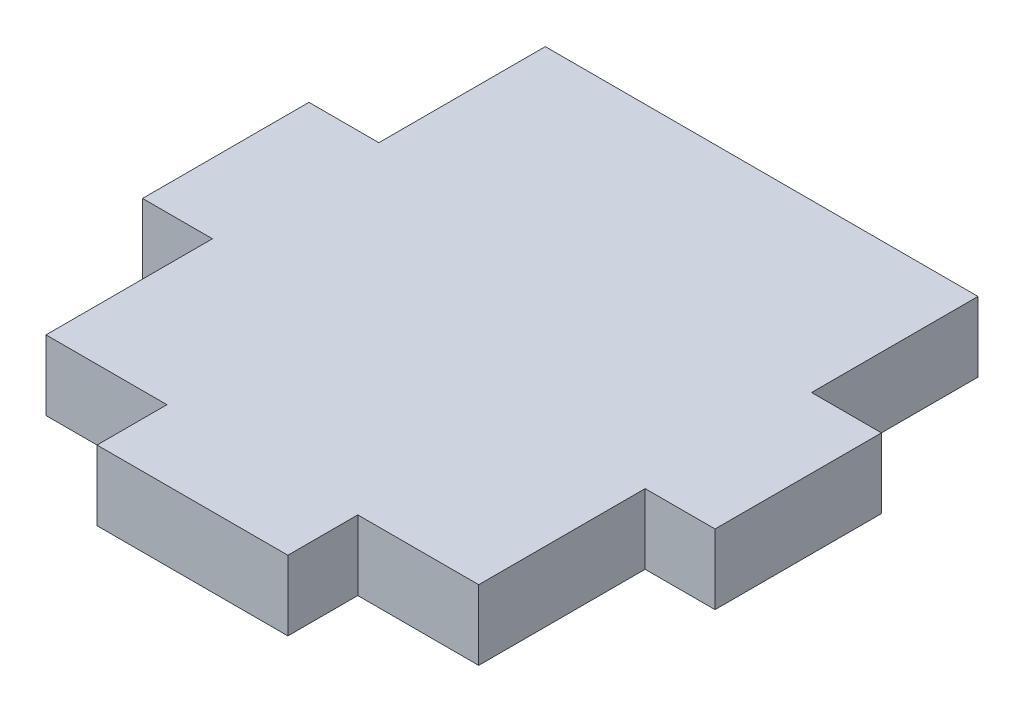
ISO-10303-21;
HEADER;
FILE_DESCRIPTION(('STEP AP214'),'2;1');
FILE_NAME('part.step','',(''),(''),'','','');
FILE_SCHEMA(('AUTOMOTIVE_DESIGN { 1 0 10303 214 1 1 1 1 }'));
ENDSEC;
DATA;
#1=APPLICATION_CONTEXT('core data for automotive mechanical design processes');
#2=APPLICATION_PROTOCOL_DEFINITION('international standard','automotive_design',2000,#1);
#3=PRODUCT_CONTEXT('',#1,'mechanical');
#4=PRODUCT('Part','Part','',(#3));
#5=PRODUCT_RELATED_PRODUCT_CATEGORY('part','',(#4));
#6=PRODUCT_DEFINITION_FORMATION('','',#4);
#7=PRODUCT_DEFINITION_CONTEXT('part definition',#1,'design');
#8=PRODUCT_DEFINITION('design','',#6,#7);
#9=PRODUCT_DEFINITION_SHAPE('','',#8);
#10=(LENGTH_UNIT() NAMED_UNIT(*) SI_UNIT(.MILLI.,.METRE.));
#11=(NAMED_UNIT(*) PLANE_ANGLE_UNIT() SI_UNIT($,.RADIAN.));
#12=(NAMED_UNIT(*) SI_UNIT($,.STERADIAN.) SOLID_ANGLE_UNIT());
#13=UNCERTAINTY_MEASURE_WITH_UNIT(LENGTH_MEASURE(1.E-05),#10,'distance_accuracy_value','');
#14=(GEOMETRIC_REPRESENTATION_CONTEXT(3) GLOBAL_UNCERTAINTY_ASSIGNED_CONTEXT((#13)) GLOBAL_UNIT_ASSIGNED_CONTEXT((#10,
#11,#12)) REPRESENTATION_CONTEXT('',''));
#15=CARTESIAN_POINT('',(0.,0.,0.));
#16=DIRECTION('',(0.,0.,1.));
#17=DIRECTION('',(1.,0.,0.));
#18=AXIS2_PLACEMENT_3D('',#15,#16,#17);
#19=CARTESIAN_POINT('',(16.51,2.667,19.05));
#20=DIRECTION('',(-1.,0.,0.));
#21=DIRECTION('',(0.,0.,1.));
#22=AXIS2_PLACEMENT_3D('',#19,#20,#21);
#23=PLANE('',#22);
#24=DIRECTION('',(0.,1.,0.));
#25=VECTOR('',#24,1.);
#26=CARTESIAN_POINT('',(16.51,-2.667,-6.35));
#27=LINE('',#26,#25);
#28=CARTESIAN_POINT('',(16.51,-2.667,-6.35));
#29=VERTEX_POINT('',#28);
#30=CARTESIAN_POINT('',(16.51,2.667,-6.35));
#31=VERTEX_POINT('',#30);
#32=EDGE_CURVE('E179',#29,#31,#27,.T.);
#33=ORIENTED_EDGE('',*,*,#32,.F.);
#34=DIRECTION('',(0.,0.,-1.));
#35=VECTOR('',#34,1.);
#36=CARTESIAN_POINT('',(16.51,-2.667,19.05));
#37=LINE('',#36,#35);
#38=CARTESIAN_POINT('',(16.51,-2.667,-19.05));
#39=VERTEX_POINT('',#38);
#40=EDGE_CURVE('E220',#29,#39,#37,.T.);
#41=ORIENTED_EDGE('',*,*,#40,.T.);
#42=DIRECTION('',(0.,-1.,0.));
#43=VECTOR('',#42,1.);
#44=CARTESIAN_POINT('',(16.51,2.667,-19.05));
#45=LINE('',#44,#43);
#46=CARTESIAN_POINT('',(16.51,2.667,-19.05));
#47=VERTEX_POINT('',#46);
#48=EDGE_CURVE('E11',#47,#39,#45,.T.);
#49=ORIENTED_EDGE('',*,*,#48,.F.);
#50=DIRECTION('',(0.,0.,-1.));
#51=VECTOR('',#50,1.);
#52=CARTESIAN_POINT('',(16.51,2.667,19.05));
#53=LINE('',#52,#51);
#54=EDGE_CURVE('E274',#31,#47,#53,.T.);
#55=ORIENTED_EDGE('',*,*,#54,.F.);
#56=EDGE_LOOP('',(#33,#41,#49,#55));
#57=FACE_BOUND('',#56,.T.);
#58=ADVANCED_FACE('F34',(#57),#23,.F.);
#59=CARTESIAN_POINT('',(-16.51,2.667,19.05));
#60=DIRECTION('',(1.,0.,0.));
#61=DIRECTION('',(0.,0.,-1.));
#62=AXIS2_PLACEMENT_3D('',#59,#60,#61);
#63=PLANE('',#62);
#64=DIRECTION('',(0.,1.,0.));
#65=VECTOR('',#64,1.);
#66=CARTESIAN_POINT('',(-16.51,-2.667,6.35));
#67=LINE('',#66,#65);
#68=CARTESIAN_POINT('',(-16.51,-2.667,6.35));
#69=VERTEX_POINT('',#68);
#70=CARTESIAN_POINT('',(-16.51,2.667,6.35));
#71=VERTEX_POINT('',#70);
#72=EDGE_CURVE('E202',#69,#71,#67,.T.);
#73=ORIENTED_EDGE('',*,*,#72,.F.);
#74=DIRECTION('',(0.,0.,1.));
#75=VECTOR('',#74,1.);
#76=CARTESIAN_POINT('',(-16.51,-2.667,19.05));
#77=LINE('',#76,#75);
#78=CARTESIAN_POINT('',(-16.51,-2.667,19.05));
#79=VERTEX_POINT('',#78);
#80=EDGE_CURVE('E229',#69,#79,#77,.T.);
#81=ORIENTED_EDGE('',*,*,#80,.T.);
#82=DIRECTION('',(0.,-1.,0.));
#83=VECTOR('',#82,1.);
#84=CARTESIAN_POINT('',(-16.51,2.667,19.05));
#85=LINE('',#84,#83);
#86=CARTESIAN_POINT('',(-16.51,2.667,19.05));
#87=VERTEX_POINT('',#86);
#88=EDGE_CURVE('E329',#87,#79,#85,.T.);
#89=ORIENTED_EDGE('',*,*,#88,.F.);
#90=DIRECTION('',(0.,0.,1.));
#91=VECTOR('',#90,1.);
#92=CARTESIAN_POINT('',(-16.51,2.667,19.05));
#93=LINE('',#92,#91);
#94=EDGE_CURVE('E280',#71,#87,#93,.T.);
#95=ORIENTED_EDGE('',*,*,#94,.F.);
#96=EDGE_LOOP('',(#73,#81,#89,#95));
#97=FACE_BOUND('',#96,.T.);
#98=ADVANCED_FACE('F370',(#97),#63,.F.);
#99=CARTESIAN_POINT('',(-16.51,2.667,19.05));
#100=DIRECTION('',(0.,0.,-1.));
#101=DIRECTION('',(-1.,0.,0.));
#102=AXIS2_PLACEMENT_3D('',#99,#100,#101);
#103=PLANE('',#102);
#104=DIRECTION('',(0.,1.,0.));
#105=VECTOR('',#104,1.);
#106=CARTESIAN_POINT('',(7.28133333333333,-2.667,19.05));
#107=LINE('',#106,#105);
#108=CARTESIAN_POINT('',(7.28133333333333,-2.667,19.05));
#109=VERTEX_POINT('',#108);
#110=CARTESIAN_POINT('',(7.28133333333333,2.667,19.05));
#111=VERTEX_POINT('',#110);
#112=EDGE_CURVE('E255',#109,#111,#107,.T.);
#113=ORIENTED_EDGE('',*,*,#112,.F.);
#114=DIRECTION('',(1.,0.,0.));
#115=VECTOR('',#114,1.);
#116=CARTESIAN_POINT('',(-16.51,-2.667,19.05));
#117=LINE('',#116,#115);
#118=CARTESIAN_POINT('',(16.51,-2.667,19.05));
#119=VERTEX_POINT('',#118);
#120=EDGE_CURVE('E241',#109,#119,#117,.T.);
#121=ORIENTED_EDGE('',*,*,#120,.T.);
#122=DIRECTION('',(0.,-1.,0.));
#123=VECTOR('',#122,1.);
#124=CARTESIAN_POINT('',(16.51,2.667,19.05));
#125=LINE('',#124,#123);
#126=CARTESIAN_POINT('',(16.51,2.667,19.05));
#127=VERTEX_POINT('',#126);
#128=EDGE_CURVE('E296',#127,#119,#125,.T.);
#129=ORIENTED_EDGE('',*,*,#128,.F.);
#130=DIRECTION('',(1.,0.,0.));
#131=VECTOR('',#130,1.);
#132=CARTESIAN_POINT('',(-16.51,2.667,19.05));
#133=LINE('',#132,#131);
#134=EDGE_CURVE('E297',#111,#127,#133,.T.);
#135=ORIENTED_EDGE('',*,*,#134,.F.);
#136=EDGE_LOOP('',(#113,#121,#129,#135));
#137=FACE_BOUND('',#136,.T.);
#138=ADVANCED_FACE('F325',(#137),#103,.F.);
#139=CARTESIAN_POINT('',(16.51,-2.667,6.35));
#140=VERTEX_POINT('',#139);
#141=EDGE_CURVE('E216',#119,#140,#37,.T.);
#142=ORIENTED_EDGE('',*,*,#141,.T.);
#143=DIRECTION('',(0.,1.,0.));
#144=VECTOR('',#143,1.);
#145=CARTESIAN_POINT('',(16.51,-2.667,6.35));
#146=LINE('',#145,#144);
#147=CARTESIAN_POINT('',(16.51,2.667,6.35));
#148=VERTEX_POINT('',#147);
#149=EDGE_CURVE('E169',#140,#148,#146,.T.);
#150=ORIENTED_EDGE('',*,*,#149,.T.);
#151=EDGE_CURVE('E276',#127,#148,#53,.T.);
#152=ORIENTED_EDGE('',*,*,#151,.F.);
#153=ORIENTED_EDGE('',*,*,#128,.T.);
#154=EDGE_LOOP('',(#142,#150,#152,#153));
#155=FACE_BOUND('',#154,.T.);
#156=ADVANCED_FACE('F36',(#155),#23,.F.);
#157=CARTESIAN_POINT('',(-16.51,2.667,-19.05));
#158=DIRECTION('',(0.,0.,1.));
#159=DIRECTION('',(1.,0.,0.));
#160=AXIS2_PLACEMENT_3D('',#157,#158,#159);
#161=PLANE('',#160);
#162=DIRECTION('',(-1.,0.,0.));
#163=VECTOR('',#162,1.);
#164=CARTESIAN_POINT('',(-16.51,-2.667,-19.05));
#165=LINE('',#164,#163);
#166=CARTESIAN_POINT('',(-16.51,-2.667,-19.05));
#167=VERTEX_POINT('',#166);
#168=EDGE_CURVE('E219',#39,#167,#165,.T.);
#169=ORIENTED_EDGE('',*,*,#168,.T.);
#170=DIRECTION('',(0.,-1.,0.));
#171=VECTOR('',#170,1.);
#172=CARTESIAN_POINT('',(-16.51,2.667,-19.05));
#173=LINE('',#172,#171);
#174=CARTESIAN_POINT('',(-16.51,2.667,-19.05));
#175=VERTEX_POINT('',#174);
#176=EDGE_CURVE('E43',#175,#167,#173,.T.);
#177=ORIENTED_EDGE('',*,*,#176,.F.);
#178=DIRECTION('',(-1.,0.,0.));
#179=VECTOR('',#178,1.);
#180=CARTESIAN_POINT('',(-16.51,2.667,-19.05));
#181=LINE('',#180,#179);
#182=EDGE_CURVE('E271',#47,#175,#181,.T.);
#183=ORIENTED_EDGE('',*,*,#182,.F.);
#184=ORIENTED_EDGE('',*,*,#48,.T.);
#185=EDGE_LOOP('',(#169,#177,#183,#184));
#186=FACE_BOUND('',#185,.T.);
#187=ADVANCED_FACE('F353',(#186),#161,.F.);
#188=CARTESIAN_POINT('',(-16.51,-2.667,-6.35));
#189=VERTEX_POINT('',#188);
#190=EDGE_CURVE('E238',#167,#189,#77,.T.);
#191=ORIENTED_EDGE('',*,*,#190,.T.);
#192=DIRECTION('',(0.,1.,0.));
#193=VECTOR('',#192,1.);
#194=CARTESIAN_POINT('',(-16.51,-2.667,-6.35));
#195=LINE('',#194,#193);
#196=CARTESIAN_POINT('',(-16.51,2.667,-6.34999999999999));
#197=VERTEX_POINT('',#196);
#198=EDGE_CURVE('E209',#189,#197,#195,.T.);
#199=ORIENTED_EDGE('',*,*,#198,.T.);
#200=EDGE_CURVE('E299',#175,#197,#93,.T.);
#201=ORIENTED_EDGE('',*,*,#200,.F.);
#202=ORIENTED_EDGE('',*,*,#176,.T.);
#203=EDGE_LOOP('',(#191,#199,#201,#202));
#204=FACE_BOUND('',#203,.T.);
#205=ADVANCED_FACE('F336',(#204),#63,.F.);
#206=CARTESIAN_POINT('',(-7.28133333333333,-2.667,19.05));
#207=VERTEX_POINT('',#206);
#208=EDGE_CURVE('E281',#79,#207,#117,.T.);
#209=ORIENTED_EDGE('',*,*,#208,.T.);
#210=DIRECTION('',(0.,1.,0.));
#211=VECTOR('',#210,1.);
#212=CARTESIAN_POINT('',(-7.28133333333333,-2.667,19.05));
#213=LINE('',#212,#211);
#214=CARTESIAN_POINT('',(-7.28133333333333,2.667,19.05));
#215=VERTEX_POINT('',#214);
#216=EDGE_CURVE('E258',#207,#215,#213,.T.);
#217=ORIENTED_EDGE('',*,*,#216,.T.);
#218=EDGE_CURVE('E293',#87,#215,#133,.T.);
#219=ORIENTED_EDGE('',*,*,#218,.F.);
#220=ORIENTED_EDGE('',*,*,#88,.T.);
#221=EDGE_LOOP('',(#209,#217,#219,#220));
#222=FACE_BOUND('',#221,.T.);
#223=ADVANCED_FACE('F382',(#222),#103,.F.);
#224=CARTESIAN_POINT('',(16.51,2.667,-19.05));
#225=DIRECTION('',(0.,-1.,0.));
#226=DIRECTION('',(0.,0.,-1.));
#227=AXIS2_PLACEMENT_3D('',#224,#225,#226);
#228=PLANE('',#227);
#229=ORIENTED_EDGE('',*,*,#151,.T.);
#230=DIRECTION('',(1.,0.,0.));
#231=VECTOR('',#230,1.);
#232=CARTESIAN_POINT('',(16.51,2.667,6.35));
#233=LINE('',#232,#231);
#234=CARTESIAN_POINT('',(21.844,2.667,6.35));
#235=VERTEX_POINT('',#234);
#236=EDGE_CURVE('E51',#148,#235,#233,.T.);
#237=ORIENTED_EDGE('',*,*,#236,.T.);
#238=DIRECTION('',(0.,0.,-1.));
#239=VECTOR('',#238,1.);
#240=CARTESIAN_POINT('',(21.844,2.667,6.35));
#241=LINE('',#240,#239);
#242=CARTESIAN_POINT('',(21.844,2.667,-6.35));
#243=VERTEX_POINT('',#242);
#244=EDGE_CURVE('E154',#235,#243,#241,.T.);
#245=ORIENTED_EDGE('',*,*,#244,.T.);
#246=DIRECTION('',(-1.,0.,0.));
#247=VECTOR('',#246,1.);
#248=CARTESIAN_POINT('',(16.51,2.667,-6.35));
#249=LINE('',#248,#247);
#250=EDGE_CURVE('E170',#243,#31,#249,.T.);
#251=ORIENTED_EDGE('',*,*,#250,.T.);
#252=ORIENTED_EDGE('',*,*,#54,.T.);
#253=ORIENTED_EDGE('',*,*,#182,.T.);
#254=ORIENTED_EDGE('',*,*,#200,.T.);
#255=DIRECTION('',(-1.,0.,0.));
#256=VECTOR('',#255,1.);
#257=CARTESIAN_POINT('',(-16.51,2.667,-6.35));
#258=LINE('',#257,#256);
#259=CARTESIAN_POINT('',(-21.844,2.667,-6.35));
#260=VERTEX_POINT('',#259);
#261=EDGE_CURVE('E59',#197,#260,#258,.T.);
#262=ORIENTED_EDGE('',*,*,#261,.T.);
#263=DIRECTION('',(0.,0.,1.));
#264=VECTOR('',#263,1.);
#265=CARTESIAN_POINT('',(-21.844,2.667,6.35));
#266=LINE('',#265,#264);
#267=CARTESIAN_POINT('',(-21.844,2.667,6.35));
#268=VERTEX_POINT('',#267);
#269=EDGE_CURVE('E193',#260,#268,#266,.T.);
#270=ORIENTED_EDGE('',*,*,#269,.T.);
#271=DIRECTION('',(1.,0.,0.));
#272=VECTOR('',#271,1.);
#273=CARTESIAN_POINT('',(-16.51,2.667,6.35));
#274=LINE('',#273,#272);
#275=EDGE_CURVE('E196',#268,#71,#274,.T.);
#276=ORIENTED_EDGE('',*,*,#275,.T.);
#277=ORIENTED_EDGE('',*,*,#94,.T.);
#278=ORIENTED_EDGE('',*,*,#218,.T.);
#279=DIRECTION('',(0.,0.,1.));
#280=VECTOR('',#279,1.);
#281=CARTESIAN_POINT('',(-7.28133333333333,2.667,19.05));
#282=LINE('',#281,#280);
#283=CARTESIAN_POINT('',(-7.28133333333334,2.667,24.384));
#284=VERTEX_POINT('',#283);
#285=EDGE_CURVE('E205',#215,#284,#282,.T.);
#286=ORIENTED_EDGE('',*,*,#285,.T.);
#287=DIRECTION('',(1.,0.,0.));
#288=VECTOR('',#287,1.);
#289=CARTESIAN_POINT('',(-7.28133333333334,2.667,24.384));
#290=LINE('',#289,#288);
#291=CARTESIAN_POINT('',(7.28133333333334,2.667,24.384));
#292=VERTEX_POINT('',#291);
#293=EDGE_CURVE('E248',#284,#292,#290,.T.);
#294=ORIENTED_EDGE('',*,*,#293,.T.);
#295=DIRECTION('',(0.,0.,-1.));
#296=VECTOR('',#295,1.);
#297=CARTESIAN_POINT('',(7.28133333333333,2.667,19.05));
#298=LINE('',#297,#296);
#299=EDGE_CURVE('E244',#292,#111,#298,.T.);
#300=ORIENTED_EDGE('',*,*,#299,.T.);
#301=ORIENTED_EDGE('',*,*,#134,.T.);
#302=EDGE_LOOP('',(#229,#237,#245,#251,#252,#253,#254,#262,#270,#276,#277,#278,#286,#294,#300,#301));
#303=FACE_BOUND('',#302,.T.);
#304=ADVANCED_FACE('F315',(#303),#228,.F.);
#305=CARTESIAN_POINT('',(16.51,-2.667,-19.05));
#306=DIRECTION('',(0.,-1.,0.));
#307=DIRECTION('',(0.,0.,-1.));
#308=AXIS2_PLACEMENT_3D('',#305,#306,#307);
#309=PLANE('',#308);
#310=ORIENTED_EDGE('',*,*,#141,.F.);
#311=ORIENTED_EDGE('',*,*,#120,.F.);
#312=DIRECTION('',(0.,0.,-1.));
#313=VECTOR('',#312,1.);
#314=CARTESIAN_POINT('',(7.28133333333333,-2.667,19.05));
#315=LINE('',#314,#313);
#316=CARTESIAN_POINT('',(7.28133333333334,-2.667,24.384));
#317=VERTEX_POINT('',#316);
#318=EDGE_CURVE('E251',#317,#109,#315,.T.);
#319=ORIENTED_EDGE('',*,*,#318,.F.);
#320=DIRECTION('',(1.,0.,0.));
#321=VECTOR('',#320,1.);
#322=CARTESIAN_POINT('',(-7.28133333333334,-2.667,24.384));
#323=LINE('',#322,#321);
#324=CARTESIAN_POINT('',(-7.28133333333334,-2.667,24.384));
#325=VERTEX_POINT('',#324);
#326=EDGE_CURVE('E254',#325,#317,#323,.T.);
#327=ORIENTED_EDGE('',*,*,#326,.F.);
#328=DIRECTION('',(0.,0.,1.));
#329=VECTOR('',#328,1.);
#330=CARTESIAN_POINT('',(-7.28133333333333,-2.667,19.05));
#331=LINE('',#330,#329);
#332=EDGE_CURVE('E247',#207,#325,#331,.T.);
#333=ORIENTED_EDGE('',*,*,#332,.F.);
#334=ORIENTED_EDGE('',*,*,#208,.F.);
#335=ORIENTED_EDGE('',*,*,#80,.F.);
#336=DIRECTION('',(1.,0.,0.));
#337=VECTOR('',#336,1.);
#338=CARTESIAN_POINT('',(-16.51,-2.667,6.35));
#339=LINE('',#338,#337);
#340=CARTESIAN_POINT('',(-21.844,-2.667,6.35));
#341=VERTEX_POINT('',#340);
#342=EDGE_CURVE('E191',#341,#69,#339,.T.);
#343=ORIENTED_EDGE('',*,*,#342,.F.);
#344=DIRECTION('',(0.,0.,1.));
#345=VECTOR('',#344,1.);
#346=CARTESIAN_POINT('',(-21.844,-2.667,6.35));
#347=LINE('',#346,#345);
#348=CARTESIAN_POINT('',(-21.844,-2.667,-6.35));
#349=VERTEX_POINT('',#348);
#350=EDGE_CURVE('E188',#349,#341,#347,.T.);
#351=ORIENTED_EDGE('',*,*,#350,.F.);
#352=DIRECTION('',(-1.,0.,0.));
#353=VECTOR('',#352,1.);
#354=CARTESIAN_POINT('',(-16.51,-2.667,-6.35));
#355=LINE('',#354,#353);
#356=EDGE_CURVE('E192',#189,#349,#355,.T.);
#357=ORIENTED_EDGE('',*,*,#356,.F.);
#358=ORIENTED_EDGE('',*,*,#190,.F.);
#359=ORIENTED_EDGE('',*,*,#168,.F.);
#360=ORIENTED_EDGE('',*,*,#40,.F.);
#361=DIRECTION('',(-1.,0.,0.));
#362=VECTOR('',#361,1.);
#363=CARTESIAN_POINT('',(16.51,-2.667,-6.35));
#364=LINE('',#363,#362);
#365=CARTESIAN_POINT('',(21.844,-2.667,-6.35));
#366=VERTEX_POINT('',#365);
#367=EDGE_CURVE('E157',#366,#29,#364,.T.);
#368=ORIENTED_EDGE('',*,*,#367,.F.);
#369=DIRECTION('',(0.,0.,-1.));
#370=VECTOR('',#369,1.);
#371=CARTESIAN_POINT('',(21.844,-2.667,6.35));
#372=LINE('',#371,#370);
#373=CARTESIAN_POINT('',(21.844,-2.667,6.35));
#374=VERTEX_POINT('',#373);
#375=EDGE_CURVE('E152',#374,#366,#372,.T.);
#376=ORIENTED_EDGE('',*,*,#375,.F.);
#377=DIRECTION('',(1.,0.,0.));
#378=VECTOR('',#377,1.);
#379=CARTESIAN_POINT('',(16.51,-2.667,6.35));
#380=LINE('',#379,#378);
#381=EDGE_CURVE('E164',#140,#374,#380,.T.);
#382=ORIENTED_EDGE('',*,*,#381,.F.);
#383=EDGE_LOOP('',(#310,#311,#319,#327,#333,#334,#335,#343,#351,#357,#358,#359,#360,#368,#376,#382));
#384=FACE_BOUND('',#383,.T.);
#385=ADVANCED_FACE('F163',(#384),#309,.T.);
#386=CARTESIAN_POINT('',(-7.28133333333333,-2.667,19.05));
#387=DIRECTION('',(-1.,0.,0.));
#388=DIRECTION('',(0.,0.,1.));
#389=AXIS2_PLACEMENT_3D('',#386,#387,#388);
#390=PLANE('',#389);
#391=ORIENTED_EDGE('',*,*,#285,.F.);
#392=ORIENTED_EDGE('',*,*,#216,.F.);
#393=ORIENTED_EDGE('',*,*,#332,.T.);
#394=DIRECTION('',(0.,1.,0.));
#395=VECTOR('',#394,1.);
#396=CARTESIAN_POINT('',(-7.28133333333334,-2.667,24.384));
#397=LINE('',#396,#395);
#398=EDGE_CURVE('E253',#325,#284,#397,.T.);
#399=ORIENTED_EDGE('',*,*,#398,.T.);
#400=EDGE_LOOP('',(#391,#392,#393,#399));
#401=FACE_BOUND('',#400,.T.);
#402=ADVANCED_FACE('F427',(#401),#390,.T.);
#403=CARTESIAN_POINT('',(7.28133333333333,-2.667,19.05));
#404=DIRECTION('',(1.,0.,0.));
#405=DIRECTION('',(0.,0.,-1.));
#406=AXIS2_PLACEMENT_3D('',#403,#404,#405);
#407=PLANE('',#406);
#408=ORIENTED_EDGE('',*,*,#299,.F.);
#409=DIRECTION('',(0.,1.,0.));
#410=VECTOR('',#409,1.);
#411=CARTESIAN_POINT('',(7.28133333333334,-2.667,24.384));
#412=LINE('',#411,#410);
#413=EDGE_CURVE('E259',#317,#292,#412,.T.);
#414=ORIENTED_EDGE('',*,*,#413,.F.);
#415=ORIENTED_EDGE('',*,*,#318,.T.);
#416=ORIENTED_EDGE('',*,*,#112,.T.);
#417=EDGE_LOOP('',(#408,#414,#415,#416));
#418=FACE_BOUND('',#417,.T.);
#419=ADVANCED_FACE('F321',(#418),#407,.T.);
#420=CARTESIAN_POINT('',(-7.28133333333334,-2.667,24.384));
#421=DIRECTION('',(0.,0.,1.));
#422=DIRECTION('',(1.,0.,0.));
#423=AXIS2_PLACEMENT_3D('',#420,#421,#422);
#424=PLANE('',#423);
#425=ORIENTED_EDGE('',*,*,#293,.F.);
#426=ORIENTED_EDGE('',*,*,#398,.F.);
#427=ORIENTED_EDGE('',*,*,#326,.T.);
#428=ORIENTED_EDGE('',*,*,#413,.T.);
#429=EDGE_LOOP('',(#425,#426,#427,#428));
#430=FACE_BOUND('',#429,.T.);
#431=ADVANCED_FACE('F318',(#430),#424,.T.);
#432=CARTESIAN_POINT('',(-16.51,-2.667,6.35));
#433=DIRECTION('',(0.,0.,1.));
#434=DIRECTION('',(1.,0.,0.));
#435=AXIS2_PLACEMENT_3D('',#432,#433,#434);
#436=PLANE('',#435);
#437=ORIENTED_EDGE('',*,*,#275,.F.);
#438=DIRECTION('',(0.,1.,0.));
#439=VECTOR('',#438,1.);
#440=CARTESIAN_POINT('',(-21.844,-2.667,6.35));
#441=LINE('',#440,#439);
#442=EDGE_CURVE('E199',#341,#268,#441,.T.);
#443=ORIENTED_EDGE('',*,*,#442,.F.);
#444=ORIENTED_EDGE('',*,*,#342,.T.);
#445=ORIENTED_EDGE('',*,*,#72,.T.);
#446=EDGE_LOOP('',(#437,#443,#444,#445));
#447=FACE_BOUND('',#446,.T.);
#448=ADVANCED_FACE('F475',(#447),#436,.T.);
#449=CARTESIAN_POINT('',(-21.844,-2.667,6.35));
#450=DIRECTION('',(-1.,0.,0.));
#451=DIRECTION('',(0.,0.,1.));
#452=AXIS2_PLACEMENT_3D('',#449,#450,#451);
#453=PLANE('',#452);
#454=ORIENTED_EDGE('',*,*,#269,.F.);
#455=DIRECTION('',(0.,1.,0.));
#456=VECTOR('',#455,1.);
#457=CARTESIAN_POINT('',(-21.844,-2.667,-6.35));
#458=LINE('',#457,#456);
#459=EDGE_CURVE('E346',#349,#260,#458,.T.);
#460=ORIENTED_EDGE('',*,*,#459,.F.);
#461=ORIENTED_EDGE('',*,*,#350,.T.);
#462=ORIENTED_EDGE('',*,*,#442,.T.);
#463=EDGE_LOOP('',(#454,#460,#461,#462));
#464=FACE_BOUND('',#463,.T.);
#465=ADVANCED_FACE('F484',(#464),#453,.T.);
#466=CARTESIAN_POINT('',(-16.51,-2.667,-6.35));
#467=DIRECTION('',(0.,0.,-1.));
#468=DIRECTION('',(-1.,0.,0.));
#469=AXIS2_PLACEMENT_3D('',#466,#467,#468);
#470=PLANE('',#469);
#471=ORIENTED_EDGE('',*,*,#261,.F.);
#472=ORIENTED_EDGE('',*,*,#198,.F.);
#473=ORIENTED_EDGE('',*,*,#356,.T.);
#474=ORIENTED_EDGE('',*,*,#459,.T.);
#475=EDGE_LOOP('',(#471,#472,#473,#474));
#476=FACE_BOUND('',#475,.T.);
#477=ADVANCED_FACE('F367',(#476),#470,.T.);
#478=CARTESIAN_POINT('',(16.51,-2.667,6.35));
#479=DIRECTION('',(0.,0.,1.));
#480=DIRECTION('',(1.,0.,0.));
#481=AXIS2_PLACEMENT_3D('',#478,#479,#480);
#482=PLANE('',#481);
#483=ORIENTED_EDGE('',*,*,#236,.F.);
#484=ORIENTED_EDGE('',*,*,#149,.F.);
#485=ORIENTED_EDGE('',*,*,#381,.T.);
#486=DIRECTION('',(0.,1.,0.));
#487=VECTOR('',#486,1.);
#488=CARTESIAN_POINT('',(21.844,-2.667,6.35));
#489=LINE('',#488,#487);
#490=EDGE_CURVE('E149',#374,#235,#489,.T.);
#491=ORIENTED_EDGE('',*,*,#490,.T.);
#492=EDGE_LOOP('',(#483,#484,#485,#491));
#493=FACE_BOUND('',#492,.T.);
#494=ADVANCED_FACE('F168',(#493),#482,.T.);
#495=CARTESIAN_POINT('',(16.51,-2.667,-6.35));
#496=DIRECTION('',(0.,0.,-1.));
#497=DIRECTION('',(-1.,0.,0.));
#498=AXIS2_PLACEMENT_3D('',#495,#496,#497);
#499=PLANE('',#498);
#500=ORIENTED_EDGE('',*,*,#250,.F.);
#501=DIRECTION('',(0.,1.,0.));
#502=VECTOR('',#501,1.);
#503=CARTESIAN_POINT('',(21.844,-2.667,-6.35));
#504=LINE('',#503,#502);
#505=EDGE_CURVE('E156',#366,#243,#504,.T.);
#506=ORIENTED_EDGE('',*,*,#505,.F.);
#507=ORIENTED_EDGE('',*,*,#367,.T.);
#508=ORIENTED_EDGE('',*,*,#32,.T.);
#509=EDGE_LOOP('',(#500,#506,#507,#508));
#510=FACE_BOUND('',#509,.T.);
#511=ADVANCED_FACE('F358',(#510),#499,.T.);
#512=CARTESIAN_POINT('',(21.844,-2.667,6.35));
#513=DIRECTION('',(1.,0.,0.));
#514=DIRECTION('',(0.,0.,-1.));
#515=AXIS2_PLACEMENT_3D('',#512,#513,#514);
#516=PLANE('',#515);
#517=ORIENTED_EDGE('',*,*,#244,.F.);
#518=ORIENTED_EDGE('',*,*,#490,.F.);
#519=ORIENTED_EDGE('',*,*,#375,.T.);
#520=ORIENTED_EDGE('',*,*,#505,.T.);
#521=EDGE_LOOP('',(#517,#518,#519,#520));
#522=FACE_BOUND('',#521,.T.);
#523=ADVANCED_FACE('F151',(#522),#516,.T.);
#524=CLOSED_SHELL('',(#58,#98,#138,#156,#187,#205,#223,#304,#385,#402,#419,#431,#448,#465,#477,
#494,#511,#523));
#525=MANIFOLD_SOLID_BREP('B2',#524);
#526=ADVANCED_BREP_SHAPE_REPRESENTATION('',(#18,#525),#14);
#527=SHAPE_DEFINITION_REPRESENTATION(#9,#526);
ENDSEC;
END-ISO-10303-21;
